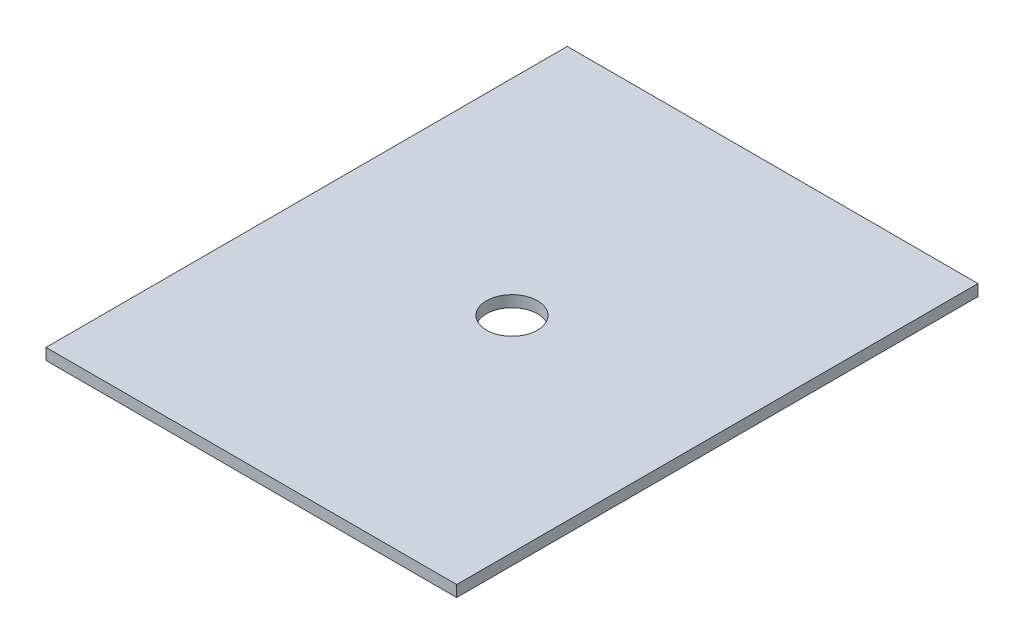
ISO-10303-21;
HEADER;
FILE_DESCRIPTION(('STEP AP214'),'2;1');
FILE_NAME('part.step','',(''),(''),'','','');
FILE_SCHEMA(('AUTOMOTIVE_DESIGN { 1 0 10303 214 1 1 1 1 }'));
ENDSEC;
DATA;
#1=APPLICATION_CONTEXT('core data for automotive mechanical design processes');
#2=APPLICATION_PROTOCOL_DEFINITION('international standard','automotive_design',2000,#1);
#3=PRODUCT_CONTEXT('',#1,'mechanical');
#4=PRODUCT('Part','Part','',(#3));
#5=PRODUCT_RELATED_PRODUCT_CATEGORY('part','',(#4));
#6=PRODUCT_DEFINITION_FORMATION('','',#4);
#7=PRODUCT_DEFINITION_CONTEXT('part definition',#1,'design');
#8=PRODUCT_DEFINITION('design','',#6,#7);
#9=PRODUCT_DEFINITION_SHAPE('','',#8);
#10=(LENGTH_UNIT() NAMED_UNIT(*) SI_UNIT(.MILLI.,.METRE.));
#11=(NAMED_UNIT(*) PLANE_ANGLE_UNIT() SI_UNIT($,.RADIAN.));
#12=(NAMED_UNIT(*) SI_UNIT($,.STERADIAN.) SOLID_ANGLE_UNIT());
#13=UNCERTAINTY_MEASURE_WITH_UNIT(LENGTH_MEASURE(1.E-05),#10,'distance_accuracy_value','');
#14=(GEOMETRIC_REPRESENTATION_CONTEXT(3) GLOBAL_UNCERTAINTY_ASSIGNED_CONTEXT((#13)) GLOBAL_UNIT_ASSIGNED_CONTEXT((#10,
#11,#12)) REPRESENTATION_CONTEXT('',''));
#15=CARTESIAN_POINT('',(0.,0.,0.));
#16=DIRECTION('',(0.,0.,1.));
#17=DIRECTION('',(1.,0.,0.));
#18=AXIS2_PLACEMENT_3D('',#15,#16,#17);
#19=CARTESIAN_POINT('',(0.,6.35,0.));
#20=DIRECTION('',(1.,0.,0.));
#21=DIRECTION('',(0.,0.,-1.));
#22=AXIS2_PLACEMENT_3D('',#19,#20,#21);
#23=PLANE('',#22);
#24=DIRECTION('',(0.,0.,1.));
#25=VECTOR('',#24,1.);
#26=CARTESIAN_POINT('',(0.,0.,0.));
#27=LINE('',#26,#25);
#28=CARTESIAN_POINT('',(0.,0.,-292.1));
#29=VERTEX_POINT('',#28);
#30=CARTESIAN_POINT('',(0.,0.,0.));
#31=VERTEX_POINT('',#30);
#32=EDGE_CURVE('E113',#29,#31,#27,.T.);
#33=ORIENTED_EDGE('',*,*,#32,.T.);
#34=DIRECTION('',(0.,-1.,0.));
#35=VECTOR('',#34,1.);
#36=CARTESIAN_POINT('',(0.,6.35,0.));
#37=LINE('',#36,#35);
#38=CARTESIAN_POINT('',(0.,6.35,0.));
#39=VERTEX_POINT('',#38);
#40=EDGE_CURVE('E11',#39,#31,#37,.T.);
#41=ORIENTED_EDGE('',*,*,#40,.F.);
#42=DIRECTION('',(0.,0.,1.));
#43=VECTOR('',#42,1.);
#44=CARTESIAN_POINT('',(0.,6.35,0.));
#45=LINE('',#44,#43);
#46=CARTESIAN_POINT('',(0.,6.35,-292.1));
#47=VERTEX_POINT('',#46);
#48=EDGE_CURVE('E97',#47,#39,#45,.T.);
#49=ORIENTED_EDGE('',*,*,#48,.F.);
#50=DIRECTION('',(0.,-1.,0.));
#51=VECTOR('',#50,1.);
#52=CARTESIAN_POINT('',(0.,6.35,-292.1));
#53=LINE('',#52,#51);
#54=EDGE_CURVE('E109',#47,#29,#53,.T.);
#55=ORIENTED_EDGE('',*,*,#54,.T.);
#56=EDGE_LOOP('',(#33,#41,#49,#55));
#57=FACE_BOUND('',#56,.T.);
#58=ADVANCED_FACE('F45',(#57),#23,.F.);
#59=CARTESIAN_POINT('',(0.,6.35,0.));
#60=DIRECTION('',(0.,0.,-1.));
#61=DIRECTION('',(-1.,0.,0.));
#62=AXIS2_PLACEMENT_3D('',#59,#60,#61);
#63=PLANE('',#62);
#64=DIRECTION('',(1.,0.,0.));
#65=VECTOR('',#64,1.);
#66=CARTESIAN_POINT('',(0.,0.,0.));
#67=LINE('',#66,#65);
#68=CARTESIAN_POINT('',(230.124,0.,0.));
#69=VERTEX_POINT('',#68);
#70=EDGE_CURVE('E102',#31,#69,#67,.T.);
#71=ORIENTED_EDGE('',*,*,#70,.T.);
#72=DIRECTION('',(0.,-1.,0.));
#73=VECTOR('',#72,1.);
#74=CARTESIAN_POINT('',(230.124,6.35,0.));
#75=LINE('',#74,#73);
#76=CARTESIAN_POINT('',(230.124,6.35,0.));
#77=VERTEX_POINT('',#76);
#78=EDGE_CURVE('E54',#77,#69,#75,.T.);
#79=ORIENTED_EDGE('',*,*,#78,.F.);
#80=DIRECTION('',(1.,0.,0.));
#81=VECTOR('',#80,1.);
#82=CARTESIAN_POINT('',(0.,6.35,0.));
#83=LINE('',#82,#81);
#84=EDGE_CURVE('E92',#39,#77,#83,.T.);
#85=ORIENTED_EDGE('',*,*,#84,.F.);
#86=ORIENTED_EDGE('',*,*,#40,.T.);
#87=EDGE_LOOP('',(#71,#79,#85,#86));
#88=FACE_BOUND('',#87,.T.);
#89=ADVANCED_FACE('F101',(#88),#63,.F.);
#90=CARTESIAN_POINT('',(230.124,6.35,0.));
#91=DIRECTION('',(-1.,0.,0.));
#92=DIRECTION('',(0.,0.,1.));
#93=AXIS2_PLACEMENT_3D('',#90,#91,#92);
#94=PLANE('',#93);
#95=DIRECTION('',(0.,0.,-1.));
#96=VECTOR('',#95,1.);
#97=CARTESIAN_POINT('',(230.124,0.,0.));
#98=LINE('',#97,#96);
#99=CARTESIAN_POINT('',(230.124,0.,-292.1));
#100=VERTEX_POINT('',#99);
#101=EDGE_CURVE('E79',#69,#100,#98,.T.);
#102=ORIENTED_EDGE('',*,*,#101,.T.);
#103=DIRECTION('',(0.,-1.,0.));
#104=VECTOR('',#103,1.);
#105=CARTESIAN_POINT('',(230.124,6.35,-292.1));
#106=LINE('',#105,#104);
#107=CARTESIAN_POINT('',(230.124,6.35,-292.1));
#108=VERTEX_POINT('',#107);
#109=EDGE_CURVE('E104',#108,#100,#106,.T.);
#110=ORIENTED_EDGE('',*,*,#109,.F.);
#111=DIRECTION('',(0.,0.,-1.));
#112=VECTOR('',#111,1.);
#113=CARTESIAN_POINT('',(230.124,6.35,0.));
#114=LINE('',#113,#112);
#115=EDGE_CURVE('E95',#77,#108,#114,.T.);
#116=ORIENTED_EDGE('',*,*,#115,.F.);
#117=ORIENTED_EDGE('',*,*,#78,.T.);
#118=EDGE_LOOP('',(#102,#110,#116,#117));
#119=FACE_BOUND('',#118,.T.);
#120=ADVANCED_FACE('F105',(#119),#94,.F.);
#121=CARTESIAN_POINT('',(0.,6.35,-292.1));
#122=DIRECTION('',(0.,0.,1.));
#123=DIRECTION('',(1.,0.,0.));
#124=AXIS2_PLACEMENT_3D('',#121,#122,#123);
#125=PLANE('',#124);
#126=DIRECTION('',(-1.,0.,0.));
#127=VECTOR('',#126,1.);
#128=CARTESIAN_POINT('',(0.,0.,-292.1));
#129=LINE('',#128,#127);
#130=EDGE_CURVE('E85',#100,#29,#129,.T.);
#131=ORIENTED_EDGE('',*,*,#130,.T.);
#132=ORIENTED_EDGE('',*,*,#54,.F.);
#133=DIRECTION('',(-1.,0.,0.));
#134=VECTOR('',#133,1.);
#135=CARTESIAN_POINT('',(0.,6.35,-292.1));
#136=LINE('',#135,#134);
#137=EDGE_CURVE('E62',#108,#47,#136,.T.);
#138=ORIENTED_EDGE('',*,*,#137,.F.);
#139=ORIENTED_EDGE('',*,*,#109,.T.);
#140=EDGE_LOOP('',(#131,#132,#138,#139));
#141=FACE_BOUND('',#140,.T.);
#142=ADVANCED_FACE('F127',(#141),#125,.F.);
#143=CARTESIAN_POINT('',(0.,6.35,0.));
#144=DIRECTION('',(0.,-1.,0.));
#145=DIRECTION('',(0.,0.,-1.));
#146=AXIS2_PLACEMENT_3D('',#143,#144,#145);
#147=PLANE('',#146);
#148=CARTESIAN_POINT('',(115.062,6.35,-146.05));
#149=DIRECTION('',(0.,1.,0.));
#150=DIRECTION('',(0.,0.,1.));
#151=AXIS2_PLACEMENT_3D('',#148,#149,#150);
#152=CIRCLE('',#151,14.2875);
#153=CARTESIAN_POINT('',(115.062,6.35,-131.7625));
#154=VERTEX_POINT('',#153);
#155=EDGE_CURVE('E134',#154,#154,#152,.T.);
#156=ORIENTED_EDGE('',*,*,#155,.F.);
#157=EDGE_LOOP('',(#156));
#158=FACE_BOUND('',#157,.T.);
#159=ORIENTED_EDGE('',*,*,#48,.T.);
#160=ORIENTED_EDGE('',*,*,#84,.T.);
#161=ORIENTED_EDGE('',*,*,#115,.T.);
#162=ORIENTED_EDGE('',*,*,#137,.T.);
#163=EDGE_LOOP('',(#159,#160,#161,#162));
#164=FACE_BOUND('',#163,.T.);
#165=ADVANCED_FACE('F93',(#158,#164),#147,.F.);
#166=CARTESIAN_POINT('',(0.,0.,0.));
#167=DIRECTION('',(0.,-1.,0.));
#168=DIRECTION('',(0.,0.,-1.));
#169=AXIS2_PLACEMENT_3D('',#166,#167,#168);
#170=PLANE('',#169);
#171=CARTESIAN_POINT('',(115.062,0.,-146.05));
#172=DIRECTION('',(0.,1.,0.));
#173=DIRECTION('',(0.,0.,1.));
#174=AXIS2_PLACEMENT_3D('',#171,#172,#173);
#175=CIRCLE('',#174,14.2875);
#176=CARTESIAN_POINT('',(115.062,0.,-131.7625));
#177=VERTEX_POINT('',#176);
#178=EDGE_CURVE('E117',#177,#177,#175,.T.);
#179=ORIENTED_EDGE('',*,*,#178,.T.);
#180=EDGE_LOOP('',(#179));
#181=FACE_BOUND('',#180,.T.);
#182=ORIENTED_EDGE('',*,*,#32,.F.);
#183=ORIENTED_EDGE('',*,*,#130,.F.);
#184=ORIENTED_EDGE('',*,*,#101,.F.);
#185=ORIENTED_EDGE('',*,*,#70,.F.);
#186=EDGE_LOOP('',(#182,#183,#184,#185));
#187=FACE_BOUND('',#186,.T.);
#188=ADVANCED_FACE('F130',(#181,#187),#170,.T.);
#189=CARTESIAN_POINT('',(115.062,0.,-146.05));
#190=DIRECTION('',(0.,1.,0.));
#191=DIRECTION('',(0.,0.,1.));
#192=AXIS2_PLACEMENT_3D('',#189,#190,#191);
#193=CYLINDRICAL_SURFACE('',#192,14.2875);
#194=ORIENTED_EDGE('',*,*,#178,.F.);
#195=EDGE_LOOP('',(#194));
#196=FACE_BOUND('',#195,.T.);
#197=ORIENTED_EDGE('',*,*,#155,.T.);
#198=EDGE_LOOP('',(#197));
#199=FACE_BOUND('',#198,.T.);
#200=ADVANCED_FACE('F143',(#196,#199),#193,.F.);
#201=CLOSED_SHELL('',(#58,#89,#120,#142,#165,#188,#200));
#202=MANIFOLD_SOLID_BREP('B2',#201);
#203=ADVANCED_BREP_SHAPE_REPRESENTATION('',(#18,#202),#14);
#204=SHAPE_DEFINITION_REPRESENTATION(#9,#203);
ENDSEC;
END-ISO-10303-21;
